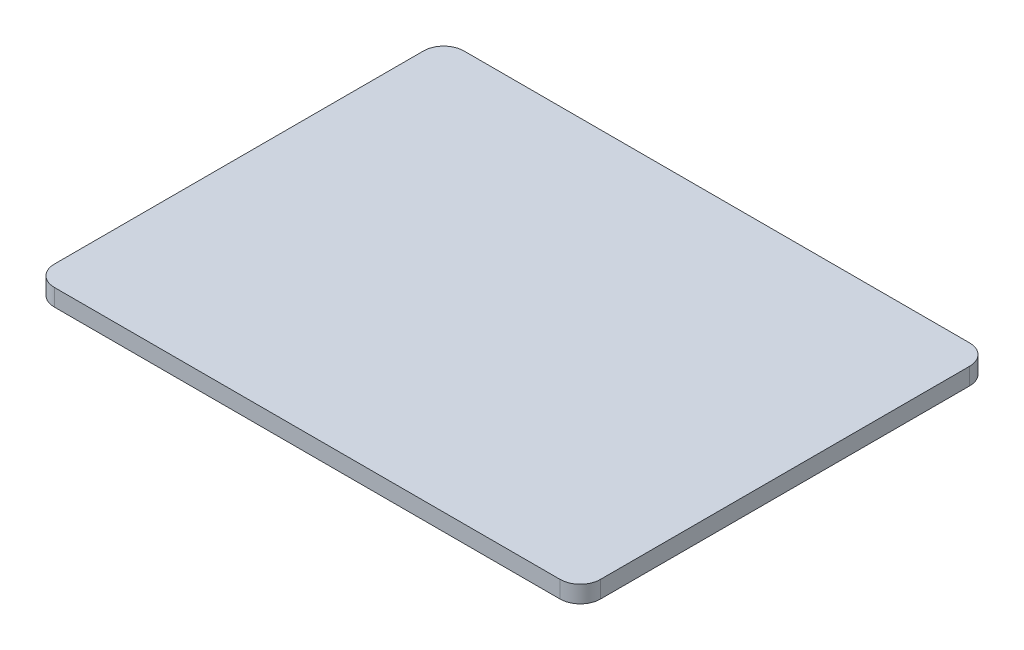
ISO-10303-21;
HEADER;
FILE_DESCRIPTION(('STEP AP214'),'2;1');
FILE_NAME('part.step','',(''),(''),'','','');
FILE_SCHEMA(('AUTOMOTIVE_DESIGN { 1 0 10303 214 1 1 1 1 }'));
ENDSEC;
DATA;
#1=APPLICATION_CONTEXT('core data for automotive mechanical design processes');
#2=APPLICATION_PROTOCOL_DEFINITION('international standard','automotive_design',2000,#1);
#3=PRODUCT_CONTEXT('',#1,'mechanical');
#4=PRODUCT('Part','Part','',(#3));
#5=PRODUCT_RELATED_PRODUCT_CATEGORY('part','',(#4));
#6=PRODUCT_DEFINITION_FORMATION('','',#4);
#7=PRODUCT_DEFINITION_CONTEXT('part definition',#1,'design');
#8=PRODUCT_DEFINITION('design','',#6,#7);
#9=PRODUCT_DEFINITION_SHAPE('','',#8);
#10=(LENGTH_UNIT() NAMED_UNIT(*) SI_UNIT(.MILLI.,.METRE.));
#11=(NAMED_UNIT(*) PLANE_ANGLE_UNIT() SI_UNIT($,.RADIAN.));
#12=(NAMED_UNIT(*) SI_UNIT($,.STERADIAN.) SOLID_ANGLE_UNIT());
#13=UNCERTAINTY_MEASURE_WITH_UNIT(LENGTH_MEASURE(1.E-05),#10,'distance_accuracy_value','');
#14=(GEOMETRIC_REPRESENTATION_CONTEXT(3) GLOBAL_UNCERTAINTY_ASSIGNED_CONTEXT((#13)) GLOBAL_UNIT_ASSIGNED_CONTEXT((#10,
#11,#12)) REPRESENTATION_CONTEXT('',''));
#15=CARTESIAN_POINT('',(0.,0.,0.));
#16=DIRECTION('',(0.,0.,1.));
#17=DIRECTION('',(1.,0.,0.));
#18=AXIS2_PLACEMENT_3D('',#15,#16,#17);
#19=CARTESIAN_POINT('',(376.4,25.4,274.8));
#20=DIRECTION('',(0.,-1.,0.));
#21=DIRECTION('',(0.,0.,-1.));
#22=AXIS2_PLACEMENT_3D('',#19,#20,#21);
#23=CYLINDRICAL_SURFACE('',#22,30.);
#24=CARTESIAN_POINT('',(376.4,0.,274.8));
#25=DIRECTION('',(0.,1.,0.));
#26=DIRECTION('',(0.,0.,1.));
#27=AXIS2_PLACEMENT_3D('',#24,#25,#26);
#28=CIRCLE('',#27,30.);
#29=CARTESIAN_POINT('',(376.4,0.,304.8));
#30=VERTEX_POINT('',#29);
#31=CARTESIAN_POINT('',(406.4,0.,274.8));
#32=VERTEX_POINT('',#31);
#33=EDGE_CURVE('E129',#30,#32,#28,.T.);
#34=ORIENTED_EDGE('',*,*,#33,.T.);
#35=DIRECTION('',(0.,-1.,0.));
#36=VECTOR('',#35,1.);
#37=CARTESIAN_POINT('',(406.4,25.4,274.8));
#38=LINE('',#37,#36);
#39=CARTESIAN_POINT('',(406.4,25.4,274.8));
#40=VERTEX_POINT('',#39);
#41=EDGE_CURVE('E11',#40,#32,#38,.T.);
#42=ORIENTED_EDGE('',*,*,#41,.F.);
#43=CARTESIAN_POINT('',(376.4,25.4,274.8));
#44=DIRECTION('',(0.,1.,0.));
#45=DIRECTION('',(0.,0.,1.));
#46=AXIS2_PLACEMENT_3D('',#43,#44,#45);
#47=CIRCLE('',#46,30.);
#48=CARTESIAN_POINT('',(376.4,25.4,304.8));
#49=VERTEX_POINT('',#48);
#50=EDGE_CURVE('E143',#49,#40,#47,.T.);
#51=ORIENTED_EDGE('',*,*,#50,.F.);
#52=DIRECTION('',(0.,-1.,0.));
#53=VECTOR('',#52,1.);
#54=CARTESIAN_POINT('',(376.4,25.4,304.8));
#55=LINE('',#54,#53);
#56=EDGE_CURVE('E125',#49,#30,#55,.T.);
#57=ORIENTED_EDGE('',*,*,#56,.T.);
#58=EDGE_LOOP('',(#34,#42,#51,#57));
#59=FACE_BOUND('',#58,.T.);
#60=ADVANCED_FACE('F33',(#59),#23,.T.);
#61=CARTESIAN_POINT('',(406.4,25.4,-274.8));
#62=DIRECTION('',(-1.,0.,0.));
#63=DIRECTION('',(0.,0.,1.));
#64=AXIS2_PLACEMENT_3D('',#61,#62,#63);
#65=PLANE('',#64);
#66=DIRECTION('',(0.,0.,-1.));
#67=VECTOR('',#66,1.);
#68=CARTESIAN_POINT('',(406.4,0.,-274.8));
#69=LINE('',#68,#67);
#70=CARTESIAN_POINT('',(406.4,0.,-274.8));
#71=VERTEX_POINT('',#70);
#72=EDGE_CURVE('E132',#32,#71,#69,.T.);
#73=ORIENTED_EDGE('',*,*,#72,.T.);
#74=DIRECTION('',(0.,-1.,0.));
#75=VECTOR('',#74,1.);
#76=CARTESIAN_POINT('',(406.4,25.4,-274.8));
#77=LINE('',#76,#75);
#78=CARTESIAN_POINT('',(406.4,25.4,-274.8));
#79=VERTEX_POINT('',#78);
#80=EDGE_CURVE('E41',#79,#71,#77,.T.);
#81=ORIENTED_EDGE('',*,*,#80,.F.);
#82=DIRECTION('',(0.,0.,-1.));
#83=VECTOR('',#82,1.);
#84=CARTESIAN_POINT('',(406.4,25.4,-274.8));
#85=LINE('',#84,#83);
#86=EDGE_CURVE('E92',#40,#79,#85,.T.);
#87=ORIENTED_EDGE('',*,*,#86,.F.);
#88=ORIENTED_EDGE('',*,*,#41,.T.);
#89=EDGE_LOOP('',(#73,#81,#87,#88));
#90=FACE_BOUND('',#89,.T.);
#91=ADVANCED_FACE('F178',(#90),#65,.F.);
#92=CARTESIAN_POINT('',(376.4,25.4,-274.8));
#93=DIRECTION('',(0.,-1.,0.));
#94=DIRECTION('',(0.,0.,-1.));
#95=AXIS2_PLACEMENT_3D('',#92,#93,#94);
#96=CYLINDRICAL_SURFACE('',#95,30.);
#97=CARTESIAN_POINT('',(376.4,0.,-274.8));
#98=DIRECTION('',(0.,1.,0.));
#99=DIRECTION('',(0.,0.,1.));
#100=AXIS2_PLACEMENT_3D('',#97,#98,#99);
#101=CIRCLE('',#100,30.);
#102=CARTESIAN_POINT('',(376.4,0.,-304.8));
#103=VERTEX_POINT('',#102);
#104=EDGE_CURVE('E134',#71,#103,#101,.T.);
#105=ORIENTED_EDGE('',*,*,#104,.T.);
#106=DIRECTION('',(0.,-1.,0.));
#107=VECTOR('',#106,1.);
#108=CARTESIAN_POINT('',(376.4,25.4,-304.8));
#109=LINE('',#108,#107);
#110=CARTESIAN_POINT('',(376.4,25.4,-304.8));
#111=VERTEX_POINT('',#110);
#112=EDGE_CURVE('E150',#111,#103,#109,.T.);
#113=ORIENTED_EDGE('',*,*,#112,.F.);
#114=CARTESIAN_POINT('',(376.4,25.4,-274.8));
#115=DIRECTION('',(0.,1.,0.));
#116=DIRECTION('',(0.,0.,1.));
#117=AXIS2_PLACEMENT_3D('',#114,#115,#116);
#118=CIRCLE('',#117,30.);
#119=EDGE_CURVE('E158',#79,#111,#118,.T.);
#120=ORIENTED_EDGE('',*,*,#119,.F.);
#121=ORIENTED_EDGE('',*,*,#80,.T.);
#122=EDGE_LOOP('',(#105,#113,#120,#121));
#123=FACE_BOUND('',#122,.T.);
#124=ADVANCED_FACE('F156',(#123),#96,.T.);
#125=CARTESIAN_POINT('',(-376.4,25.4,-304.8));
#126=DIRECTION('',(0.,0.,1.));
#127=DIRECTION('',(1.,0.,0.));
#128=AXIS2_PLACEMENT_3D('',#125,#126,#127);
#129=PLANE('',#128);
#130=DIRECTION('',(-1.,0.,0.));
#131=VECTOR('',#130,1.);
#132=CARTESIAN_POINT('',(-376.4,0.,-304.8));
#133=LINE('',#132,#131);
#134=CARTESIAN_POINT('',(-376.4,0.,-304.8));
#135=VERTEX_POINT('',#134);
#136=EDGE_CURVE('E136',#103,#135,#133,.T.);
#137=ORIENTED_EDGE('',*,*,#136,.T.);
#138=DIRECTION('',(0.,-1.,0.));
#139=VECTOR('',#138,1.);
#140=CARTESIAN_POINT('',(-376.4,25.4,-304.8));
#141=LINE('',#140,#139);
#142=CARTESIAN_POINT('',(-376.4,25.4,-304.8));
#143=VERTEX_POINT('',#142);
#144=EDGE_CURVE('E147',#143,#135,#141,.T.);
#145=ORIENTED_EDGE('',*,*,#144,.F.);
#146=DIRECTION('',(-1.,0.,0.));
#147=VECTOR('',#146,1.);
#148=CARTESIAN_POINT('',(-376.4,25.4,-304.8));
#149=LINE('',#148,#147);
#150=EDGE_CURVE('E170',#111,#143,#149,.T.);
#151=ORIENTED_EDGE('',*,*,#150,.F.);
#152=ORIENTED_EDGE('',*,*,#112,.T.);
#153=EDGE_LOOP('',(#137,#145,#151,#152));
#154=FACE_BOUND('',#153,.T.);
#155=ADVANCED_FACE('F166',(#154),#129,.F.);
#156=CARTESIAN_POINT('',(-376.4,25.4,-274.8));
#157=DIRECTION('',(0.,-1.,0.));
#158=DIRECTION('',(0.,0.,-1.));
#159=AXIS2_PLACEMENT_3D('',#156,#157,#158);
#160=CYLINDRICAL_SURFACE('',#159,30.);
#161=CARTESIAN_POINT('',(-376.4,0.,-274.8));
#162=DIRECTION('',(0.,1.,0.));
#163=DIRECTION('',(0.,0.,1.));
#164=AXIS2_PLACEMENT_3D('',#161,#162,#163);
#165=CIRCLE('',#164,30.);
#166=CARTESIAN_POINT('',(-406.4,0.,-274.8));
#167=VERTEX_POINT('',#166);
#168=EDGE_CURVE('E138',#135,#167,#165,.T.);
#169=ORIENTED_EDGE('',*,*,#168,.T.);
#170=DIRECTION('',(0.,-1.,0.));
#171=VECTOR('',#170,1.);
#172=CARTESIAN_POINT('',(-406.4,25.4,-274.8));
#173=LINE('',#172,#171);
#174=CARTESIAN_POINT('',(-406.4,25.4,-274.8));
#175=VERTEX_POINT('',#174);
#176=EDGE_CURVE('E120',#175,#167,#173,.T.);
#177=ORIENTED_EDGE('',*,*,#176,.F.);
#178=CARTESIAN_POINT('',(-376.4,25.4,-274.8));
#179=DIRECTION('',(0.,1.,0.));
#180=DIRECTION('',(0.,0.,1.));
#181=AXIS2_PLACEMENT_3D('',#178,#179,#180);
#182=CIRCLE('',#181,30.);
#183=EDGE_CURVE('E111',#143,#175,#182,.T.);
#184=ORIENTED_EDGE('',*,*,#183,.F.);
#185=ORIENTED_EDGE('',*,*,#144,.T.);
#186=EDGE_LOOP('',(#169,#177,#184,#185));
#187=FACE_BOUND('',#186,.T.);
#188=ADVANCED_FACE('F169',(#187),#160,.T.);
#189=CARTESIAN_POINT('',(-406.4,25.4,-274.8));
#190=DIRECTION('',(1.,0.,0.));
#191=DIRECTION('',(0.,0.,-1.));
#192=AXIS2_PLACEMENT_3D('',#189,#190,#191);
#193=PLANE('',#192);
#194=DIRECTION('',(0.,0.,1.));
#195=VECTOR('',#194,1.);
#196=CARTESIAN_POINT('',(-406.4,0.,-274.8));
#197=LINE('',#196,#195);
#198=CARTESIAN_POINT('',(-406.4,0.,274.8));
#199=VERTEX_POINT('',#198);
#200=EDGE_CURVE('E119',#167,#199,#197,.T.);
#201=ORIENTED_EDGE('',*,*,#200,.T.);
#202=DIRECTION('',(0.,-1.,0.));
#203=VECTOR('',#202,1.);
#204=CARTESIAN_POINT('',(-406.4,25.4,274.8));
#205=LINE('',#204,#203);
#206=CARTESIAN_POINT('',(-406.4,25.4,274.8));
#207=VERTEX_POINT('',#206);
#208=EDGE_CURVE('E116',#207,#199,#205,.T.);
#209=ORIENTED_EDGE('',*,*,#208,.F.);
#210=DIRECTION('',(0.,0.,1.));
#211=VECTOR('',#210,1.);
#212=CARTESIAN_POINT('',(-406.4,25.4,-274.8));
#213=LINE('',#212,#211);
#214=EDGE_CURVE('E105',#175,#207,#213,.T.);
#215=ORIENTED_EDGE('',*,*,#214,.F.);
#216=ORIENTED_EDGE('',*,*,#176,.T.);
#217=EDGE_LOOP('',(#201,#209,#215,#216));
#218=FACE_BOUND('',#217,.T.);
#219=ADVANCED_FACE('F117',(#218),#193,.F.);
#220=CARTESIAN_POINT('',(-376.4,25.4,274.8));
#221=DIRECTION('',(0.,-1.,0.));
#222=DIRECTION('',(0.,0.,-1.));
#223=AXIS2_PLACEMENT_3D('',#220,#221,#222);
#224=CYLINDRICAL_SURFACE('',#223,30.);
#225=CARTESIAN_POINT('',(-376.4,0.,274.8));
#226=DIRECTION('',(0.,1.,0.));
#227=DIRECTION('',(0.,0.,-1.));
#228=AXIS2_PLACEMENT_3D('',#225,#226,#227);
#229=CIRCLE('',#228,30.);
#230=CARTESIAN_POINT('',(-376.4,0.,304.8));
#231=VERTEX_POINT('',#230);
#232=EDGE_CURVE('E78',#199,#231,#229,.T.);
#233=ORIENTED_EDGE('',*,*,#232,.T.);
#234=DIRECTION('',(0.,-1.,0.));
#235=VECTOR('',#234,1.);
#236=CARTESIAN_POINT('',(-376.4,25.4,304.8));
#237=LINE('',#236,#235);
#238=CARTESIAN_POINT('',(-376.4,25.4,304.8));
#239=VERTEX_POINT('',#238);
#240=EDGE_CURVE('E121',#239,#231,#237,.T.);
#241=ORIENTED_EDGE('',*,*,#240,.F.);
#242=CARTESIAN_POINT('',(-376.4,25.4,274.8));
#243=DIRECTION('',(0.,1.,0.));
#244=DIRECTION('',(0.,0.,-1.));
#245=AXIS2_PLACEMENT_3D('',#242,#243,#244);
#246=CIRCLE('',#245,30.);
#247=EDGE_CURVE('E109',#207,#239,#246,.T.);
#248=ORIENTED_EDGE('',*,*,#247,.F.);
#249=ORIENTED_EDGE('',*,*,#208,.T.);
#250=EDGE_LOOP('',(#233,#241,#248,#249));
#251=FACE_BOUND('',#250,.T.);
#252=ADVANCED_FACE('F123',(#251),#224,.T.);
#253=CARTESIAN_POINT('',(-376.4,25.4,304.8));
#254=DIRECTION('',(0.,0.,-1.));
#255=DIRECTION('',(-1.,0.,0.));
#256=AXIS2_PLACEMENT_3D('',#253,#254,#255);
#257=PLANE('',#256);
#258=DIRECTION('',(1.,0.,0.));
#259=VECTOR('',#258,1.);
#260=CARTESIAN_POINT('',(-376.4,0.,304.8));
#261=LINE('',#260,#259);
#262=EDGE_CURVE('E84',#231,#30,#261,.T.);
#263=ORIENTED_EDGE('',*,*,#262,.T.);
#264=ORIENTED_EDGE('',*,*,#56,.F.);
#265=DIRECTION('',(1.,0.,0.));
#266=VECTOR('',#265,1.);
#267=CARTESIAN_POINT('',(-376.4,25.4,304.8));
#268=LINE('',#267,#266);
#269=EDGE_CURVE('E49',#239,#49,#268,.T.);
#270=ORIENTED_EDGE('',*,*,#269,.F.);
#271=ORIENTED_EDGE('',*,*,#240,.T.);
#272=EDGE_LOOP('',(#263,#264,#270,#271));
#273=FACE_BOUND('',#272,.T.);
#274=ADVANCED_FACE('F194',(#273),#257,.F.);
#275=CARTESIAN_POINT('',(376.4,25.4,274.8));
#276=DIRECTION('',(0.,1.,0.));
#277=DIRECTION('',(0.,0.,1.));
#278=AXIS2_PLACEMENT_3D('',#275,#276,#277);
#279=PLANE('',#278);
#280=ORIENTED_EDGE('',*,*,#50,.T.);
#281=ORIENTED_EDGE('',*,*,#86,.T.);
#282=ORIENTED_EDGE('',*,*,#119,.T.);
#283=ORIENTED_EDGE('',*,*,#150,.T.);
#284=ORIENTED_EDGE('',*,*,#183,.T.);
#285=ORIENTED_EDGE('',*,*,#214,.T.);
#286=ORIENTED_EDGE('',*,*,#247,.T.);
#287=ORIENTED_EDGE('',*,*,#269,.T.);
#288=EDGE_LOOP('',(#280,#281,#282,#283,#284,#285,#286,#287));
#289=FACE_BOUND('',#288,.T.);
#290=ADVANCED_FACE('F107',(#289),#279,.T.);
#291=CARTESIAN_POINT('',(376.4,0.,274.8));
#292=DIRECTION('',(0.,1.,0.));
#293=DIRECTION('',(0.,0.,1.));
#294=AXIS2_PLACEMENT_3D('',#291,#292,#293);
#295=PLANE('',#294);
#296=ORIENTED_EDGE('',*,*,#33,.F.);
#297=ORIENTED_EDGE('',*,*,#262,.F.);
#298=ORIENTED_EDGE('',*,*,#232,.F.);
#299=ORIENTED_EDGE('',*,*,#200,.F.);
#300=ORIENTED_EDGE('',*,*,#168,.F.);
#301=ORIENTED_EDGE('',*,*,#136,.F.);
#302=ORIENTED_EDGE('',*,*,#104,.F.);
#303=ORIENTED_EDGE('',*,*,#72,.F.);
#304=EDGE_LOOP('',(#296,#297,#298,#299,#300,#301,#302,#303));
#305=FACE_BOUND('',#304,.T.);
#306=ADVANCED_FACE('F162',(#305),#295,.F.);
#307=CLOSED_SHELL('',(#60,#91,#124,#155,#188,#219,#252,#274,#290,#306));
#308=MANIFOLD_SOLID_BREP('B2',#307);
#309=ADVANCED_BREP_SHAPE_REPRESENTATION('',(#18,#308),#14);
#310=SHAPE_DEFINITION_REPRESENTATION(#9,#309);
ENDSEC;
END-ISO-10303-21;
